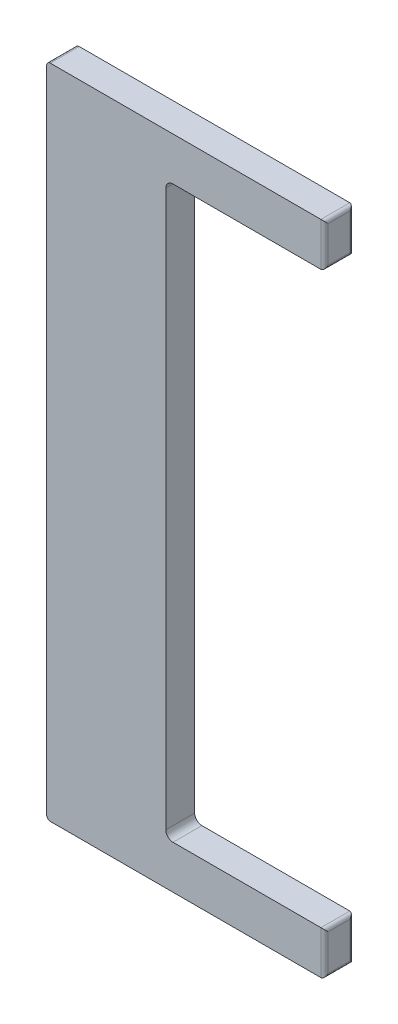
ISO-10303-21;
HEADER;
FILE_DESCRIPTION(('STEP AP214'),'2;1');
FILE_NAME('part.step','',(''),(''),'','','');
FILE_SCHEMA(('AUTOMOTIVE_DESIGN { 1 0 10303 214 1 1 1 1 }'));
ENDSEC;
DATA;
#1=APPLICATION_CONTEXT('core data for automotive mechanical design processes');
#2=APPLICATION_PROTOCOL_DEFINITION('international standard','automotive_design',2000,#1);
#3=PRODUCT_CONTEXT('',#1,'mechanical');
#4=PRODUCT('Part','Part','',(#3));
#5=PRODUCT_RELATED_PRODUCT_CATEGORY('part','',(#4));
#6=PRODUCT_DEFINITION_FORMATION('','',#4);
#7=PRODUCT_DEFINITION_CONTEXT('part definition',#1,'design');
#8=PRODUCT_DEFINITION('design','',#6,#7);
#9=PRODUCT_DEFINITION_SHAPE('','',#8);
#10=(LENGTH_UNIT() NAMED_UNIT(*) SI_UNIT(.MILLI.,.METRE.));
#11=(NAMED_UNIT(*) PLANE_ANGLE_UNIT() SI_UNIT($,.RADIAN.));
#12=(NAMED_UNIT(*) SI_UNIT($,.STERADIAN.) SOLID_ANGLE_UNIT());
#13=UNCERTAINTY_MEASURE_WITH_UNIT(LENGTH_MEASURE(1.E-05),#10,'distance_accuracy_value','');
#14=(GEOMETRIC_REPRESENTATION_CONTEXT(3) GLOBAL_UNCERTAINTY_ASSIGNED_CONTEXT((#13)) GLOBAL_UNIT_ASSIGNED_CONTEXT((#10,
#11,#12)) REPRESENTATION_CONTEXT('',''));
#15=CARTESIAN_POINT('',(0.,0.,0.));
#16=DIRECTION('',(0.,0.,1.));
#17=DIRECTION('',(1.,0.,0.));
#18=AXIS2_PLACEMENT_3D('',#15,#16,#17);
#19=CARTESIAN_POINT('',(0.,0.,101.6));
#20=DIRECTION('',(1.,0.,0.));
#21=DIRECTION('',(0.,1.,0.));
#22=AXIS2_PLACEMENT_3D('',#19,#20,#21);
#23=PLANE('',#22);
#24=DIRECTION('',(0.,-1.,0.));
#25=VECTOR('',#24,1.);
#26=CARTESIAN_POINT('',(0.,0.,101.6));
#27=LINE('',#26,#25);
#28=CARTESIAN_POINT('',(0.,-12.7,101.6));
#29=VERTEX_POINT('',#28);
#30=CARTESIAN_POINT('',(2.81509559720002E-13,-2298.7,101.6));
#31=VERTEX_POINT('',#30);
#32=EDGE_CURVE('E186',#29,#31,#27,.T.);
#33=ORIENTED_EDGE('',*,*,#32,.F.);
#34=DIRECTION('',(0.,0.,-1.));
#35=VECTOR('',#34,1.);
#36=CARTESIAN_POINT('',(0.,-12.7,101.6));
#37=LINE('',#36,#35);
#38=CARTESIAN_POINT('',(0.,-12.7,0.));
#39=VERTEX_POINT('',#38);
#40=EDGE_CURVE('E237',#29,#39,#37,.T.);
#41=ORIENTED_EDGE('',*,*,#40,.T.);
#42=DIRECTION('',(0.,-1.,0.));
#43=VECTOR('',#42,1.);
#44=CARTESIAN_POINT('',(0.,0.,0.));
#45=LINE('',#44,#43);
#46=CARTESIAN_POINT('',(2.81509559720002E-13,-2298.7,0.));
#47=VERTEX_POINT('',#46);
#48=EDGE_CURVE('E254',#39,#47,#45,.T.);
#49=ORIENTED_EDGE('',*,*,#48,.T.);
#50=DIRECTION('',(0.,0.,-1.));
#51=VECTOR('',#50,1.);
#52=CARTESIAN_POINT('',(2.81509559720002E-13,-2298.7,101.6));
#53=LINE('',#52,#51);
#54=EDGE_CURVE('E235',#47,#31,#53,.F.);
#55=ORIENTED_EDGE('',*,*,#54,.T.);
#56=EDGE_LOOP('',(#33,#41,#49,#55));
#57=FACE_BOUND('',#56,.T.);
#58=ADVANCED_FACE('F32',(#57),#23,.F.);
#59=CARTESIAN_POINT('',(2.83064861154919E-13,-2311.4,101.6));
#60=DIRECTION('',(0.,1.,0.));
#61=DIRECTION('',(0.,0.,1.));
#62=AXIS2_PLACEMENT_3D('',#59,#60,#61);
#63=PLANE('',#62);
#64=DIRECTION('',(1.,0.,0.));
#65=VECTOR('',#64,1.);
#66=CARTESIAN_POINT('',(2.83064861154919E-13,-2311.4,101.6));
#67=LINE('',#66,#65);
#68=CARTESIAN_POINT('',(12.7000000000003,-2311.4,101.6));
#69=VERTEX_POINT('',#68);
#70=CARTESIAN_POINT('',(965.2,-2311.4,101.6));
#71=VERTEX_POINT('',#70);
#72=EDGE_CURVE('E278',#69,#71,#67,.T.);
#73=ORIENTED_EDGE('',*,*,#72,.F.);
#74=DIRECTION('',(0.,0.,-1.));
#75=VECTOR('',#74,1.);
#76=CARTESIAN_POINT('',(12.7000000000003,-2311.4,101.6));
#77=LINE('',#76,#75);
#78=CARTESIAN_POINT('',(12.7000000000003,-2311.4,0.));
#79=VERTEX_POINT('',#78);
#80=EDGE_CURVE('E41',#69,#79,#77,.T.);
#81=ORIENTED_EDGE('',*,*,#80,.T.);
#82=DIRECTION('',(1.,0.,0.));
#83=VECTOR('',#82,1.);
#84=CARTESIAN_POINT('',(2.83064861154919E-13,-2311.4,0.));
#85=LINE('',#84,#83);
#86=CARTESIAN_POINT('',(965.2,-2311.4,0.));
#87=VERTEX_POINT('',#86);
#88=EDGE_CURVE('E180',#79,#87,#85,.T.);
#89=ORIENTED_EDGE('',*,*,#88,.T.);
#90=DIRECTION('',(0.,0.,-1.));
#91=VECTOR('',#90,1.);
#92=CARTESIAN_POINT('',(965.2,-2311.4,101.6));
#93=LINE('',#92,#91);
#94=EDGE_CURVE('E240',#87,#71,#93,.F.);
#95=ORIENTED_EDGE('',*,*,#94,.T.);
#96=EDGE_LOOP('',(#73,#81,#89,#95));
#97=FACE_BOUND('',#96,.T.);
#98=ADVANCED_FACE('F294',(#97),#63,.F.);
#99=CARTESIAN_POINT('',(977.9,-2159.,101.6));
#100=DIRECTION('',(-1.,0.,0.));
#101=DIRECTION('',(0.,0.,1.));
#102=AXIS2_PLACEMENT_3D('',#99,#100,#101);
#103=PLANE('',#102);
#104=DIRECTION('',(0.,1.,0.));
#105=VECTOR('',#104,1.);
#106=CARTESIAN_POINT('',(977.9,-2311.4,88.9));
#107=LINE('',#106,#105);
#108=CARTESIAN_POINT('',(977.9,-2171.7,88.9));
#109=VERTEX_POINT('',#108);
#110=CARTESIAN_POINT('',(977.9,-2298.7,88.9));
#111=VERTEX_POINT('',#110);
#112=EDGE_CURVE('E54',#109,#111,#107,.F.);
#113=ORIENTED_EDGE('',*,*,#112,.T.);
#114=DIRECTION('',(0.,0.,-1.));
#115=VECTOR('',#114,1.);
#116=CARTESIAN_POINT('',(977.9,-2298.7,101.6));
#117=LINE('',#116,#115);
#118=CARTESIAN_POINT('',(977.9,-2298.7,12.7));
#119=VERTEX_POINT('',#118);
#120=EDGE_CURVE('E49',#111,#119,#117,.T.);
#121=ORIENTED_EDGE('',*,*,#120,.T.);
#122=DIRECTION('',(0.,1.,0.));
#123=VECTOR('',#122,1.);
#124=CARTESIAN_POINT('',(977.9,-2159.,12.7));
#125=LINE('',#124,#123);
#126=CARTESIAN_POINT('',(977.9,-2171.7,12.7));
#127=VERTEX_POINT('',#126);
#128=EDGE_CURVE('E226',#119,#127,#125,.T.);
#129=ORIENTED_EDGE('',*,*,#128,.T.);
#130=DIRECTION('',(0.,0.,-1.));
#131=VECTOR('',#130,1.);
#132=CARTESIAN_POINT('',(977.9,-2171.7,101.6));
#133=LINE('',#132,#131);
#134=EDGE_CURVE('E223',#127,#109,#133,.F.);
#135=ORIENTED_EDGE('',*,*,#134,.T.);
#136=EDGE_LOOP('',(#113,#121,#129,#135));
#137=FACE_BOUND('',#136,.T.);
#138=ADVANCED_FACE('F303',(#137),#103,.F.);
#139=CARTESIAN_POINT('',(419.1,-2159.,101.6));
#140=DIRECTION('',(0.,-1.,0.));
#141=DIRECTION('',(0.,0.,-1.));
#142=AXIS2_PLACEMENT_3D('',#139,#140,#141);
#143=PLANE('',#142);
#144=DIRECTION('',(-1.,0.,0.));
#145=VECTOR('',#144,1.);
#146=CARTESIAN_POINT('',(419.1,-2159.,101.6));
#147=LINE('',#146,#145);
#148=CARTESIAN_POINT('',(965.2,-2159.,101.6));
#149=VERTEX_POINT('',#148);
#150=CARTESIAN_POINT('',(444.5,-2159.,101.6));
#151=VERTEX_POINT('',#150);
#152=EDGE_CURVE('E276',#149,#151,#147,.T.);
#153=ORIENTED_EDGE('',*,*,#152,.F.);
#154=DIRECTION('',(0.,0.,-1.));
#155=VECTOR('',#154,1.);
#156=CARTESIAN_POINT('',(965.2,-2159.,101.6));
#157=LINE('',#156,#155);
#158=CARTESIAN_POINT('',(965.2,-2159.,0.));
#159=VERTEX_POINT('',#158);
#160=EDGE_CURVE('E11',#149,#159,#157,.T.);
#161=ORIENTED_EDGE('',*,*,#160,.T.);
#162=DIRECTION('',(-1.,0.,0.));
#163=VECTOR('',#162,1.);
#164=CARTESIAN_POINT('',(419.1,-2159.,0.));
#165=LINE('',#164,#163);
#166=CARTESIAN_POINT('',(444.5,-2159.,0.));
#167=VERTEX_POINT('',#166);
#168=EDGE_CURVE('E175',#159,#167,#165,.T.);
#169=ORIENTED_EDGE('',*,*,#168,.T.);
#170=DIRECTION('',(0.,0.,-1.));
#171=VECTOR('',#170,1.);
#172=CARTESIAN_POINT('',(444.5,-2159.,101.6));
#173=LINE('',#172,#171);
#174=EDGE_CURVE('E153',#167,#151,#173,.F.);
#175=ORIENTED_EDGE('',*,*,#174,.T.);
#176=EDGE_LOOP('',(#153,#161,#169,#175));
#177=FACE_BOUND('',#176,.T.);
#178=ADVANCED_FACE('F280',(#177),#143,.F.);
#179=CARTESIAN_POINT('',(419.1,-152.4,101.6));
#180=DIRECTION('',(-1.,0.,0.));
#181=DIRECTION('',(0.,-1.,0.));
#182=AXIS2_PLACEMENT_3D('',#179,#180,#181);
#183=PLANE('',#182);
#184=DIRECTION('',(0.,1.,0.));
#185=VECTOR('',#184,1.);
#186=CARTESIAN_POINT('',(419.1,-152.4,101.6));
#187=LINE('',#186,#185);
#188=CARTESIAN_POINT('',(419.1,-2133.6,101.6));
#189=VERTEX_POINT('',#188);
#190=CARTESIAN_POINT('',(419.1,-177.8,101.6));
#191=VERTEX_POINT('',#190);
#192=EDGE_CURVE('E167',#189,#191,#187,.T.);
#193=ORIENTED_EDGE('',*,*,#192,.F.);
#194=DIRECTION('',(0.,0.,-1.));
#195=VECTOR('',#194,1.);
#196=CARTESIAN_POINT('',(419.1,-2133.6,0.));
#197=LINE('',#196,#195);
#198=CARTESIAN_POINT('',(419.1,-2133.6,0.));
#199=VERTEX_POINT('',#198);
#200=EDGE_CURVE('E151',#189,#199,#197,.T.);
#201=ORIENTED_EDGE('',*,*,#200,.T.);
#202=DIRECTION('',(0.,1.,0.));
#203=VECTOR('',#202,1.);
#204=CARTESIAN_POINT('',(419.1,-152.4,0.));
#205=LINE('',#204,#203);
#206=CARTESIAN_POINT('',(419.1,-177.8,0.));
#207=VERTEX_POINT('',#206);
#208=EDGE_CURVE('E164',#199,#207,#205,.T.);
#209=ORIENTED_EDGE('',*,*,#208,.T.);
#210=DIRECTION('',(0.,0.,-1.));
#211=VECTOR('',#210,1.);
#212=CARTESIAN_POINT('',(419.1,-177.8,101.6));
#213=LINE('',#212,#211);
#214=EDGE_CURVE('E168',#207,#191,#213,.F.);
#215=ORIENTED_EDGE('',*,*,#214,.T.);
#216=EDGE_LOOP('',(#193,#201,#209,#215));
#217=FACE_BOUND('',#216,.T.);
#218=ADVANCED_FACE('F163',(#217),#183,.F.);
#219=CARTESIAN_POINT('',(977.9,-152.4,101.6));
#220=DIRECTION('',(0.,1.,0.));
#221=DIRECTION('',(-1.,0.,0.));
#222=AXIS2_PLACEMENT_3D('',#219,#220,#221);
#223=PLANE('',#222);
#224=DIRECTION('',(1.,0.,0.));
#225=VECTOR('',#224,1.);
#226=CARTESIAN_POINT('',(977.9,-152.4,0.));
#227=LINE('',#226,#225);
#228=CARTESIAN_POINT('',(444.5,-152.4,0.));
#229=VERTEX_POINT('',#228);
#230=CARTESIAN_POINT('',(965.2,-152.4,0.));
#231=VERTEX_POINT('',#230);
#232=EDGE_CURVE('E174',#229,#231,#227,.T.);
#233=ORIENTED_EDGE('',*,*,#232,.T.);
#234=DIRECTION('',(0.,0.,-1.));
#235=VECTOR('',#234,1.);
#236=CARTESIAN_POINT('',(965.2,-152.4,101.6));
#237=LINE('',#236,#235);
#238=CARTESIAN_POINT('',(965.2,-152.4,101.6));
#239=VERTEX_POINT('',#238);
#240=EDGE_CURVE('E229',#231,#239,#237,.F.);
#241=ORIENTED_EDGE('',*,*,#240,.T.);
#242=DIRECTION('',(1.,0.,0.));
#243=VECTOR('',#242,1.);
#244=CARTESIAN_POINT('',(977.9,-152.4,101.6));
#245=LINE('',#244,#243);
#246=CARTESIAN_POINT('',(444.5,-152.4,101.6));
#247=VERTEX_POINT('',#246);
#248=EDGE_CURVE('E282',#247,#239,#245,.T.);
#249=ORIENTED_EDGE('',*,*,#248,.F.);
#250=DIRECTION('',(0.,0.,-1.));
#251=VECTOR('',#250,1.);
#252=CARTESIAN_POINT('',(444.5,-152.4,0.));
#253=LINE('',#252,#251);
#254=EDGE_CURVE('E158',#247,#229,#253,.T.);
#255=ORIENTED_EDGE('',*,*,#254,.T.);
#256=EDGE_LOOP('',(#233,#241,#249,#255));
#257=FACE_BOUND('',#256,.T.);
#258=ADVANCED_FACE('F373',(#257),#223,.F.);
#259=CARTESIAN_POINT('',(977.9,0.,101.6));
#260=DIRECTION('',(-1.,0.,0.));
#261=DIRECTION('',(0.,0.,1.));
#262=AXIS2_PLACEMENT_3D('',#259,#260,#261);
#263=PLANE('',#262);
#264=DIRECTION('',(0.,1.,0.));
#265=VECTOR('',#264,1.);
#266=CARTESIAN_POINT('',(977.9,-152.4,88.9));
#267=LINE('',#266,#265);
#268=CARTESIAN_POINT('',(977.9,-12.7,88.9));
#269=VERTEX_POINT('',#268);
#270=CARTESIAN_POINT('',(977.9,-139.7,88.9));
#271=VERTEX_POINT('',#270);
#272=EDGE_CURVE('E198',#269,#271,#267,.F.);
#273=ORIENTED_EDGE('',*,*,#272,.T.);
#274=DIRECTION('',(0.,0.,-1.));
#275=VECTOR('',#274,1.);
#276=CARTESIAN_POINT('',(977.9,-139.7,101.6));
#277=LINE('',#276,#275);
#278=CARTESIAN_POINT('',(977.9,-139.7,12.7));
#279=VERTEX_POINT('',#278);
#280=EDGE_CURVE('E203',#271,#279,#277,.T.);
#281=ORIENTED_EDGE('',*,*,#280,.T.);
#282=DIRECTION('',(0.,1.,0.));
#283=VECTOR('',#282,1.);
#284=CARTESIAN_POINT('',(977.9,0.,12.7));
#285=LINE('',#284,#283);
#286=CARTESIAN_POINT('',(977.9,-12.7,12.7));
#287=VERTEX_POINT('',#286);
#288=EDGE_CURVE('E200',#279,#287,#285,.T.);
#289=ORIENTED_EDGE('',*,*,#288,.T.);
#290=DIRECTION('',(0.,0.,-1.));
#291=VECTOR('',#290,1.);
#292=CARTESIAN_POINT('',(977.9,-12.7,101.6));
#293=LINE('',#292,#291);
#294=EDGE_CURVE('E196',#287,#269,#293,.F.);
#295=ORIENTED_EDGE('',*,*,#294,.T.);
#296=EDGE_LOOP('',(#273,#281,#289,#295));
#297=FACE_BOUND('',#296,.T.);
#298=ADVANCED_FACE('F382',(#297),#263,.F.);
#299=CARTESIAN_POINT('',(0.,0.,101.6));
#300=DIRECTION('',(0.,-1.,0.));
#301=DIRECTION('',(0.,0.,-1.));
#302=AXIS2_PLACEMENT_3D('',#299,#300,#301);
#303=PLANE('',#302);
#304=DIRECTION('',(-1.,0.,0.));
#305=VECTOR('',#304,1.);
#306=CARTESIAN_POINT('',(0.,0.,101.6));
#307=LINE('',#306,#305);
#308=CARTESIAN_POINT('',(965.2,0.,101.6));
#309=VERTEX_POINT('',#308);
#310=CARTESIAN_POINT('',(12.7,0.,101.6));
#311=VERTEX_POINT('',#310);
#312=EDGE_CURVE('E187',#309,#311,#307,.T.);
#313=ORIENTED_EDGE('',*,*,#312,.F.);
#314=DIRECTION('',(0.,0.,-1.));
#315=VECTOR('',#314,1.);
#316=CARTESIAN_POINT('',(965.2,0.,101.6));
#317=LINE('',#316,#315);
#318=CARTESIAN_POINT('',(965.2,0.,0.));
#319=VERTEX_POINT('',#318);
#320=EDGE_CURVE('E233',#309,#319,#317,.T.);
#321=ORIENTED_EDGE('',*,*,#320,.T.);
#322=DIRECTION('',(-1.,0.,0.));
#323=VECTOR('',#322,1.);
#324=CARTESIAN_POINT('',(0.,0.,0.));
#325=LINE('',#324,#323);
#326=CARTESIAN_POINT('',(12.7,0.,0.));
#327=VERTEX_POINT('',#326);
#328=EDGE_CURVE('E178',#319,#327,#325,.T.);
#329=ORIENTED_EDGE('',*,*,#328,.T.);
#330=DIRECTION('',(0.,0.,-1.));
#331=VECTOR('',#330,1.);
#332=CARTESIAN_POINT('',(12.7,0.,101.6));
#333=LINE('',#332,#331);
#334=EDGE_CURVE('E231',#327,#311,#333,.F.);
#335=ORIENTED_EDGE('',*,*,#334,.T.);
#336=EDGE_LOOP('',(#313,#321,#329,#335));
#337=FACE_BOUND('',#336,.T.);
#338=ADVANCED_FACE('F364',(#337),#303,.F.);
#339=CARTESIAN_POINT('',(0.,0.,101.6));
#340=DIRECTION('',(0.,0.,1.));
#341=DIRECTION('',(1.,0.,0.));
#342=AXIS2_PLACEMENT_3D('',#339,#340,#341);
#343=PLANE('',#342);
#344=ORIENTED_EDGE('',*,*,#248,.T.);
#345=DIRECTION('',(0.,1.,0.));
#346=VECTOR('',#345,1.);
#347=CARTESIAN_POINT('',(965.2,0.,101.6));
#348=LINE('',#347,#346);
#349=EDGE_CURVE('E221',#239,#309,#348,.T.);
#350=ORIENTED_EDGE('',*,*,#349,.T.);
#351=ORIENTED_EDGE('',*,*,#312,.T.);
#352=CARTESIAN_POINT('',(12.7,-12.7,101.6));
#353=DIRECTION('',(0.,0.,1.));
#354=DIRECTION('',(1.,0.,0.));
#355=AXIS2_PLACEMENT_3D('',#352,#353,#354);
#356=CIRCLE('',#355,12.7);
#357=EDGE_CURVE('E217',#311,#29,#356,.T.);
#358=ORIENTED_EDGE('',*,*,#357,.T.);
#359=ORIENTED_EDGE('',*,*,#32,.T.);
#360=CARTESIAN_POINT('',(12.7000000000003,-2298.7,101.6));
#361=DIRECTION('',(0.,0.,1.));
#362=DIRECTION('',(1.,0.,0.));
#363=AXIS2_PLACEMENT_3D('',#360,#361,#362);
#364=CIRCLE('',#363,12.7);
#365=EDGE_CURVE('E215',#31,#69,#364,.T.);
#366=ORIENTED_EDGE('',*,*,#365,.T.);
#367=ORIENTED_EDGE('',*,*,#72,.T.);
#368=DIRECTION('',(0.,1.,0.));
#369=VECTOR('',#368,1.);
#370=CARTESIAN_POINT('',(965.2,-2159.,101.6));
#371=LINE('',#370,#369);
#372=EDGE_CURVE('E219',#71,#149,#371,.T.);
#373=ORIENTED_EDGE('',*,*,#372,.T.);
#374=ORIENTED_EDGE('',*,*,#152,.T.);
#375=CARTESIAN_POINT('',(444.5,-2133.6,101.6));
#376=DIRECTION('',(0.,0.,1.));
#377=DIRECTION('',(1.,0.,0.));
#378=AXIS2_PLACEMENT_3D('',#375,#376,#377);
#379=CIRCLE('',#378,25.4);
#380=EDGE_CURVE('E157',#151,#189,#379,.F.);
#381=ORIENTED_EDGE('',*,*,#380,.T.);
#382=ORIENTED_EDGE('',*,*,#192,.T.);
#383=CARTESIAN_POINT('',(444.5,-177.8,101.6));
#384=DIRECTION('',(0.,0.,1.));
#385=DIRECTION('',(1.,0.,0.));
#386=AXIS2_PLACEMENT_3D('',#383,#384,#385);
#387=CIRCLE('',#386,25.4);
#388=EDGE_CURVE('E194',#191,#247,#387,.F.);
#389=ORIENTED_EDGE('',*,*,#388,.T.);
#390=EDGE_LOOP('',(#344,#350,#351,#358,#359,#366,#367,#373,#374,#381,#382,#389));
#391=FACE_BOUND('',#390,.T.);
#392=ADVANCED_FACE('F275',(#391),#343,.T.);
#393=CARTESIAN_POINT('',(0.,0.,0.));
#394=DIRECTION('',(0.,0.,1.));
#395=DIRECTION('',(1.,0.,0.));
#396=AXIS2_PLACEMENT_3D('',#393,#394,#395);
#397=PLANE('',#396);
#398=ORIENTED_EDGE('',*,*,#328,.F.);
#399=DIRECTION('',(0.,1.,0.));
#400=VECTOR('',#399,1.);
#401=CARTESIAN_POINT('',(965.2,0.,0.));
#402=LINE('',#401,#400);
#403=EDGE_CURVE('E212',#319,#231,#402,.F.);
#404=ORIENTED_EDGE('',*,*,#403,.T.);
#405=ORIENTED_EDGE('',*,*,#232,.F.);
#406=CARTESIAN_POINT('',(444.5,-177.8,0.));
#407=DIRECTION('',(0.,0.,1.));
#408=DIRECTION('',(1.,0.,0.));
#409=AXIS2_PLACEMENT_3D('',#406,#407,#408);
#410=CIRCLE('',#409,25.4);
#411=EDGE_CURVE('E173',#229,#207,#410,.T.);
#412=ORIENTED_EDGE('',*,*,#411,.T.);
#413=ORIENTED_EDGE('',*,*,#208,.F.);
#414=CARTESIAN_POINT('',(444.5,-2133.6,0.));
#415=DIRECTION('',(0.,0.,1.));
#416=DIRECTION('',(1.,0.,0.));
#417=AXIS2_PLACEMENT_3D('',#414,#415,#416);
#418=CIRCLE('',#417,25.4);
#419=EDGE_CURVE('E147',#199,#167,#418,.T.);
#420=ORIENTED_EDGE('',*,*,#419,.T.);
#421=ORIENTED_EDGE('',*,*,#168,.F.);
#422=DIRECTION('',(0.,1.,0.));
#423=VECTOR('',#422,1.);
#424=CARTESIAN_POINT('',(965.2,0.,0.));
#425=LINE('',#424,#423);
#426=EDGE_CURVE('E209',#159,#87,#425,.F.);
#427=ORIENTED_EDGE('',*,*,#426,.T.);
#428=ORIENTED_EDGE('',*,*,#88,.F.);
#429=CARTESIAN_POINT('',(12.7000000000003,-2298.7,0.));
#430=DIRECTION('',(0.,0.,1.));
#431=DIRECTION('',(1.,0.,0.));
#432=AXIS2_PLACEMENT_3D('',#429,#430,#431);
#433=CIRCLE('',#432,12.7);
#434=EDGE_CURVE('E205',#79,#47,#433,.F.);
#435=ORIENTED_EDGE('',*,*,#434,.T.);
#436=ORIENTED_EDGE('',*,*,#48,.F.);
#437=CARTESIAN_POINT('',(12.7,-12.7,0.));
#438=DIRECTION('',(0.,0.,1.));
#439=DIRECTION('',(1.,0.,0.));
#440=AXIS2_PLACEMENT_3D('',#437,#438,#439);
#441=CIRCLE('',#440,12.7);
#442=EDGE_CURVE('E207',#39,#327,#441,.F.);
#443=ORIENTED_EDGE('',*,*,#442,.T.);
#444=EDGE_LOOP('',(#398,#404,#405,#412,#413,#420,#421,#427,#428,#435,#436,#443));
#445=FACE_BOUND('',#444,.T.);
#446=ADVANCED_FACE('F171',(#445),#397,.F.);
#447=CARTESIAN_POINT('',(444.5,-2133.6,101.6));
#448=DIRECTION('',(0.,0.,1.));
#449=DIRECTION('',(1.,0.,0.));
#450=AXIS2_PLACEMENT_3D('',#447,#448,#449);
#451=CYLINDRICAL_SURFACE('',#450,25.4);
#452=ORIENTED_EDGE('',*,*,#380,.F.);
#453=ORIENTED_EDGE('',*,*,#174,.F.);
#454=ORIENTED_EDGE('',*,*,#419,.F.);
#455=ORIENTED_EDGE('',*,*,#200,.F.);
#456=EDGE_LOOP('',(#452,#453,#454,#455));
#457=FACE_BOUND('',#456,.T.);
#458=ADVANCED_FACE('F150',(#457),#451,.F.);
#459=CARTESIAN_POINT('',(444.5,-177.8,101.6));
#460=DIRECTION('',(0.,0.,1.));
#461=DIRECTION('',(1.,0.,0.));
#462=AXIS2_PLACEMENT_3D('',#459,#460,#461);
#463=CYLINDRICAL_SURFACE('',#462,25.4);
#464=ORIENTED_EDGE('',*,*,#388,.F.);
#465=ORIENTED_EDGE('',*,*,#214,.F.);
#466=ORIENTED_EDGE('',*,*,#411,.F.);
#467=ORIENTED_EDGE('',*,*,#254,.F.);
#468=EDGE_LOOP('',(#464,#465,#466,#467));
#469=FACE_BOUND('',#468,.T.);
#470=ADVANCED_FACE('F321',(#469),#463,.F.);
#471=CARTESIAN_POINT('',(965.2,0.,88.9));
#472=DIRECTION('',(0.,-1.,0.));
#473=DIRECTION('',(0.,0.,-1.));
#474=AXIS2_PLACEMENT_3D('',#471,#472,#473);
#475=CYLINDRICAL_SURFACE('',#474,12.7);
#476=CARTESIAN_POINT('',(965.2,-12.7,88.9));
#477=DIRECTION('',(0.,0.707106781186547,-0.707106781186547));
#478=DIRECTION('',(0.,-0.707106781186547,-0.707106781186547));
#479=AXIS2_PLACEMENT_3D('',#476,#477,#478);
#480=ELLIPSE('',#479,17.9605122421383,12.7);
#481=EDGE_CURVE('E248',#309,#269,#480,.T.);
#482=ORIENTED_EDGE('',*,*,#481,.F.);
#483=ORIENTED_EDGE('',*,*,#349,.F.);
#484=CARTESIAN_POINT('',(965.2,-139.7,88.9));
#485=DIRECTION('',(0.,-0.707106781186547,-0.707106781186547));
#486=DIRECTION('',(0.,0.707106781186547,-0.707106781186547));
#487=AXIS2_PLACEMENT_3D('',#484,#485,#486);
#488=ELLIPSE('',#487,17.9605122421383,12.7);
#489=EDGE_CURVE('E251',#271,#239,#488,.T.);
#490=ORIENTED_EDGE('',*,*,#489,.F.);
#491=ORIENTED_EDGE('',*,*,#272,.F.);
#492=EDGE_LOOP('',(#482,#483,#490,#491));
#493=FACE_BOUND('',#492,.T.);
#494=ADVANCED_FACE('F324',(#493),#475,.T.);
#495=CARTESIAN_POINT('',(965.2,-139.7,101.6));
#496=DIRECTION('',(0.,0.,-1.));
#497=DIRECTION('',(-1.,0.,0.));
#498=AXIS2_PLACEMENT_3D('',#495,#496,#497);
#499=CYLINDRICAL_SURFACE('',#498,12.7);
#500=ORIENTED_EDGE('',*,*,#489,.T.);
#501=ORIENTED_EDGE('',*,*,#240,.F.);
#502=CARTESIAN_POINT('',(965.2,-139.7,12.7));
#503=DIRECTION('',(0.,0.707106781186547,-0.707106781186547));
#504=DIRECTION('',(0.,-0.707106781186547,-0.707106781186547));
#505=AXIS2_PLACEMENT_3D('',#502,#503,#504);
#506=ELLIPSE('',#505,17.9605122421383,12.7);
#507=EDGE_CURVE('E246',#279,#231,#506,.T.);
#508=ORIENTED_EDGE('',*,*,#507,.F.);
#509=ORIENTED_EDGE('',*,*,#280,.F.);
#510=EDGE_LOOP('',(#500,#501,#508,#509));
#511=FACE_BOUND('',#510,.T.);
#512=ADVANCED_FACE('F333',(#511),#499,.T.);
#513=CARTESIAN_POINT('',(965.2,-12.7,101.6));
#514=DIRECTION('',(0.,0.,-1.));
#515=DIRECTION('',(-1.,0.,0.));
#516=AXIS2_PLACEMENT_3D('',#513,#514,#515);
#517=CYLINDRICAL_SURFACE('',#516,12.7);
#518=ORIENTED_EDGE('',*,*,#481,.T.);
#519=ORIENTED_EDGE('',*,*,#294,.F.);
#520=CARTESIAN_POINT('',(965.2,-12.7,12.7));
#521=DIRECTION('',(0.,-0.707106781186547,-0.707106781186547));
#522=DIRECTION('',(0.,0.707106781186547,-0.707106781186547));
#523=AXIS2_PLACEMENT_3D('',#520,#521,#522);
#524=ELLIPSE('',#523,17.9605122421383,12.7);
#525=EDGE_CURVE('E244',#319,#287,#524,.T.);
#526=ORIENTED_EDGE('',*,*,#525,.F.);
#527=ORIENTED_EDGE('',*,*,#320,.F.);
#528=EDGE_LOOP('',(#518,#519,#526,#527));
#529=FACE_BOUND('',#528,.T.);
#530=ADVANCED_FACE('F329',(#529),#517,.T.);
#531=CARTESIAN_POINT('',(965.2,0.,12.7));
#532=DIRECTION('',(0.,1.,0.));
#533=DIRECTION('',(0.,0.,1.));
#534=AXIS2_PLACEMENT_3D('',#531,#532,#533);
#535=CYLINDRICAL_SURFACE('',#534,12.7);
#536=ORIENTED_EDGE('',*,*,#507,.T.);
#537=ORIENTED_EDGE('',*,*,#403,.F.);
#538=ORIENTED_EDGE('',*,*,#525,.T.);
#539=ORIENTED_EDGE('',*,*,#288,.F.);
#540=EDGE_LOOP('',(#536,#537,#538,#539));
#541=FACE_BOUND('',#540,.T.);
#542=ADVANCED_FACE('F326',(#541),#535,.T.);
#543=CARTESIAN_POINT('',(965.2,0.,88.9));
#544=DIRECTION('',(0.,-1.,0.));
#545=DIRECTION('',(0.,0.,-1.));
#546=AXIS2_PLACEMENT_3D('',#543,#544,#545);
#547=CYLINDRICAL_SURFACE('',#546,12.7);
#548=CARTESIAN_POINT('',(965.2,-2171.7,88.9));
#549=DIRECTION('',(0.,0.707106781186547,-0.707106781186547));
#550=DIRECTION('',(0.,-0.707106781186547,-0.707106781186547));
#551=AXIS2_PLACEMENT_3D('',#548,#549,#550);
#552=ELLIPSE('',#551,17.9605122421383,12.7);
#553=EDGE_CURVE('E258',#149,#109,#552,.T.);
#554=ORIENTED_EDGE('',*,*,#553,.F.);
#555=ORIENTED_EDGE('',*,*,#372,.F.);
#556=CARTESIAN_POINT('',(965.2,-2298.7,88.9));
#557=DIRECTION('',(0.,-0.707106781186547,-0.707106781186547));
#558=DIRECTION('',(0.,0.707106781186547,-0.707106781186547));
#559=AXIS2_PLACEMENT_3D('',#556,#557,#558);
#560=ELLIPSE('',#559,17.9605122421383,12.7);
#561=EDGE_CURVE('E36',#111,#71,#560,.T.);
#562=ORIENTED_EDGE('',*,*,#561,.F.);
#563=ORIENTED_EDGE('',*,*,#112,.F.);
#564=EDGE_LOOP('',(#554,#555,#562,#563));
#565=FACE_BOUND('',#564,.T.);
#566=ADVANCED_FACE('F270',(#565),#547,.T.);
#567=CARTESIAN_POINT('',(965.2,-2298.7,101.6));
#568=DIRECTION('',(0.,0.,-1.));
#569=DIRECTION('',(-1.,0.,0.));
#570=AXIS2_PLACEMENT_3D('',#567,#568,#569);
#571=CYLINDRICAL_SURFACE('',#570,12.7);
#572=ORIENTED_EDGE('',*,*,#561,.T.);
#573=ORIENTED_EDGE('',*,*,#94,.F.);
#574=CARTESIAN_POINT('',(965.2,-2298.7,12.7));
#575=DIRECTION('',(0.,0.707106781186547,-0.707106781186547));
#576=DIRECTION('',(0.,-0.707106781186547,-0.707106781186547));
#577=AXIS2_PLACEMENT_3D('',#574,#575,#576);
#578=ELLIPSE('',#577,17.9605122421383,12.7);
#579=EDGE_CURVE('E257',#119,#87,#578,.T.);
#580=ORIENTED_EDGE('',*,*,#579,.F.);
#581=ORIENTED_EDGE('',*,*,#120,.F.);
#582=EDGE_LOOP('',(#572,#573,#580,#581));
#583=FACE_BOUND('',#582,.T.);
#584=ADVANCED_FACE('F267',(#583),#571,.T.);
#585=CARTESIAN_POINT('',(965.2,-2171.7,101.6));
#586=DIRECTION('',(0.,0.,-1.));
#587=DIRECTION('',(-1.,0.,0.));
#588=AXIS2_PLACEMENT_3D('',#585,#586,#587);
#589=CYLINDRICAL_SURFACE('',#588,12.7);
#590=ORIENTED_EDGE('',*,*,#553,.T.);
#591=ORIENTED_EDGE('',*,*,#134,.F.);
#592=CARTESIAN_POINT('',(965.2,-2171.7,12.7));
#593=DIRECTION('',(0.,-0.707106781186547,-0.707106781186547));
#594=DIRECTION('',(0.,0.707106781186547,-0.707106781186547));
#595=AXIS2_PLACEMENT_3D('',#592,#593,#594);
#596=ELLIPSE('',#595,17.9605122421383,12.7);
#597=EDGE_CURVE('E255',#159,#127,#596,.T.);
#598=ORIENTED_EDGE('',*,*,#597,.F.);
#599=ORIENTED_EDGE('',*,*,#160,.F.);
#600=EDGE_LOOP('',(#590,#591,#598,#599));
#601=FACE_BOUND('',#600,.T.);
#602=ADVANCED_FACE('F302',(#601),#589,.T.);
#603=CARTESIAN_POINT('',(965.2,-2159.,12.7));
#604=DIRECTION('',(0.,1.,0.));
#605=DIRECTION('',(0.,0.,1.));
#606=AXIS2_PLACEMENT_3D('',#603,#604,#605);
#607=CYLINDRICAL_SURFACE('',#606,12.7);
#608=ORIENTED_EDGE('',*,*,#579,.T.);
#609=ORIENTED_EDGE('',*,*,#426,.F.);
#610=ORIENTED_EDGE('',*,*,#597,.T.);
#611=ORIENTED_EDGE('',*,*,#128,.F.);
#612=EDGE_LOOP('',(#608,#609,#610,#611));
#613=FACE_BOUND('',#612,.T.);
#614=ADVANCED_FACE('F300',(#613),#607,.T.);
#615=CARTESIAN_POINT('',(12.7,-12.7,101.6));
#616=DIRECTION('',(0.,0.,-1.));
#617=DIRECTION('',(-1.,0.,0.));
#618=AXIS2_PLACEMENT_3D('',#615,#616,#617);
#619=CYLINDRICAL_SURFACE('',#618,12.7);
#620=ORIENTED_EDGE('',*,*,#357,.F.);
#621=ORIENTED_EDGE('',*,*,#334,.F.);
#622=ORIENTED_EDGE('',*,*,#442,.F.);
#623=ORIENTED_EDGE('',*,*,#40,.F.);
#624=EDGE_LOOP('',(#620,#621,#622,#623));
#625=FACE_BOUND('',#624,.T.);
#626=ADVANCED_FACE('F343',(#625),#619,.T.);
#627=CARTESIAN_POINT('',(12.7000000000003,-2298.7,101.6));
#628=DIRECTION('',(0.,0.,-1.));
#629=DIRECTION('',(-1.,0.,0.));
#630=AXIS2_PLACEMENT_3D('',#627,#628,#629);
#631=CYLINDRICAL_SURFACE('',#630,12.7);
#632=ORIENTED_EDGE('',*,*,#365,.F.);
#633=ORIENTED_EDGE('',*,*,#54,.F.);
#634=ORIENTED_EDGE('',*,*,#434,.F.);
#635=ORIENTED_EDGE('',*,*,#80,.F.);
#636=EDGE_LOOP('',(#632,#633,#634,#635));
#637=FACE_BOUND('',#636,.T.);
#638=ADVANCED_FACE('F34',(#637),#631,.T.);
#639=CLOSED_SHELL('',(#58,#98,#138,#178,#218,#258,#298,#338,#392,#446,#458,#470,#494,#512,#530,
#542,#566,#584,#602,#614,#626,#638));
#640=MANIFOLD_SOLID_BREP('B2',#639);
#641=ADVANCED_BREP_SHAPE_REPRESENTATION('',(#18,#640),#14);
#642=SHAPE_DEFINITION_REPRESENTATION(#9,#641);
ENDSEC;
END-ISO-10303-21;
